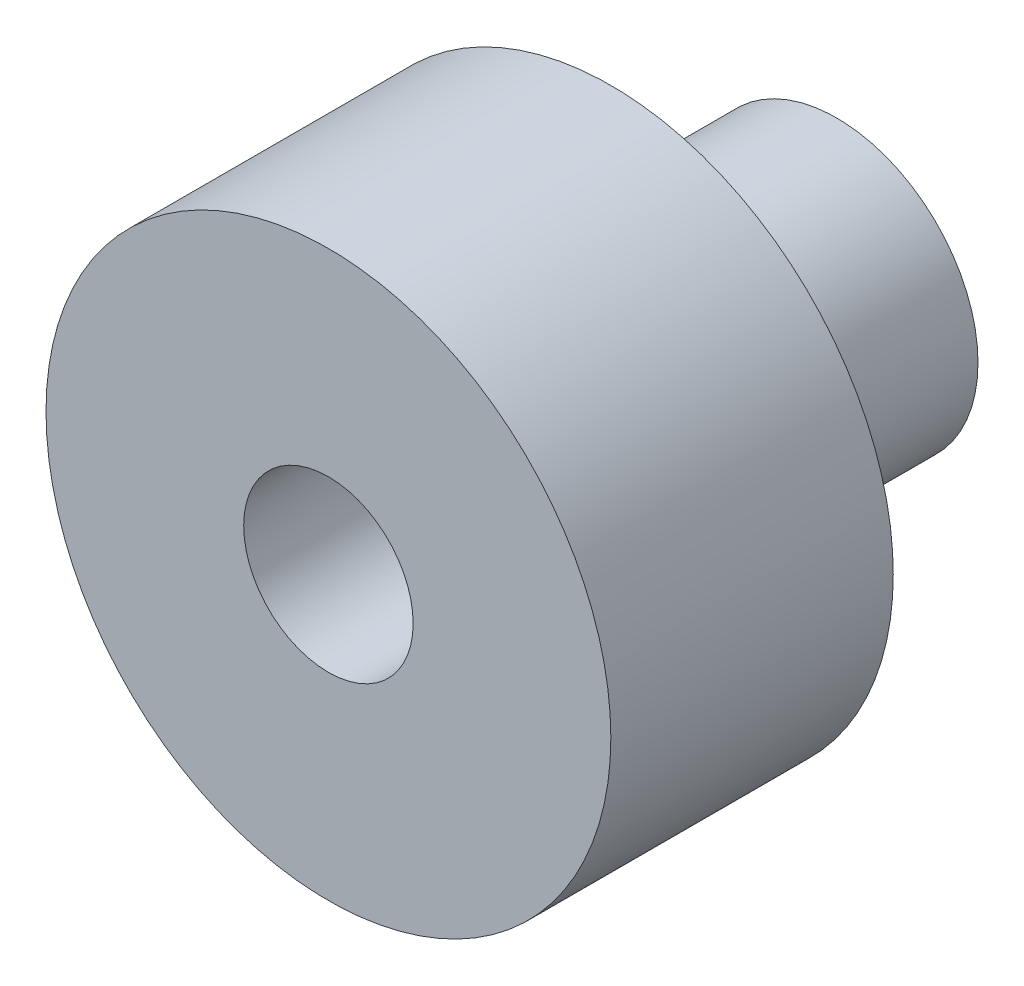
ISO-10303-21;
HEADER;
FILE_DESCRIPTION(('STEP AP214'),'2;1');
FILE_NAME('part.step','',(''),(''),'','','');
FILE_SCHEMA(('AUTOMOTIVE_DESIGN { 1 0 10303 214 1 1 1 1 }'));
ENDSEC;
DATA;
#1=APPLICATION_CONTEXT('core data for automotive mechanical design processes');
#2=APPLICATION_PROTOCOL_DEFINITION('international standard','automotive_design',2000,#1);
#3=PRODUCT_CONTEXT('',#1,'mechanical');
#4=PRODUCT('Part','Part','',(#3));
#5=PRODUCT_RELATED_PRODUCT_CATEGORY('part','',(#4));
#6=PRODUCT_DEFINITION_FORMATION('','',#4);
#7=PRODUCT_DEFINITION_CONTEXT('part definition',#1,'design');
#8=PRODUCT_DEFINITION('design','',#6,#7);
#9=PRODUCT_DEFINITION_SHAPE('','',#8);
#10=(LENGTH_UNIT() NAMED_UNIT(*) SI_UNIT(.MILLI.,.METRE.));
#11=(NAMED_UNIT(*) PLANE_ANGLE_UNIT() SI_UNIT($,.RADIAN.));
#12=(NAMED_UNIT(*) SI_UNIT($,.STERADIAN.) SOLID_ANGLE_UNIT());
#13=UNCERTAINTY_MEASURE_WITH_UNIT(LENGTH_MEASURE(1.E-05),#10,'distance_accuracy_value','');
#14=(GEOMETRIC_REPRESENTATION_CONTEXT(3) GLOBAL_UNCERTAINTY_ASSIGNED_CONTEXT((#13)) GLOBAL_UNIT_ASSIGNED_CONTEXT((#10,
#11,#12)) REPRESENTATION_CONTEXT('',''));
#15=CARTESIAN_POINT('',(0.,0.,0.));
#16=DIRECTION('',(0.,0.,1.));
#17=DIRECTION('',(1.,0.,0.));
#18=AXIS2_PLACEMENT_3D('',#15,#16,#17);
#19=CARTESIAN_POINT('',(-3.71490977829603E-05,-0.382440975897226,143.243903184503));
#20=DIRECTION('',(0.,0.,-1.));
#21=DIRECTION('',(-1.,0.,0.));
#22=AXIS2_PLACEMENT_3D('',#19,#20,#21);
#23=CYLINDRICAL_SURFACE('',#22,229.5);
#24=CARTESIAN_POINT('',(-3.71490977829603E-05,-0.382440975897226,143.243903184503));
#25=DIRECTION('',(0.,0.,1.));
#26=DIRECTION('',(1.,0.,0.));
#27=AXIS2_PLACEMENT_3D('',#24,#25,#26);
#28=CIRCLE('',#27,229.5);
#29=CARTESIAN_POINT('',(229.499962850902,-0.382440975897226,143.243903184503));
#30=VERTEX_POINT('',#29);
#31=EDGE_CURVE('E49',#30,#30,#28,.T.);
#32=ORIENTED_EDGE('',*,*,#31,.F.);
#33=EDGE_LOOP('',(#32));
#34=FACE_BOUND('',#33,.T.);
#35=CARTESIAN_POINT('',(-3.71490977829603E-05,-0.382440975897226,-86.2560968154965));
#36=DIRECTION('',(0.,0.,1.));
#37=DIRECTION('',(1.,0.,0.));
#38=AXIS2_PLACEMENT_3D('',#35,#36,#37);
#39=CIRCLE('',#38,229.5);
#40=CARTESIAN_POINT('',(229.499962850902,-0.382440975897226,-86.2560968154965));
#41=VERTEX_POINT('',#40);
#42=EDGE_CURVE('E54',#41,#41,#39,.T.);
#43=ORIENTED_EDGE('',*,*,#42,.T.);
#44=EDGE_LOOP('',(#43));
#45=FACE_BOUND('',#44,.T.);
#46=ADVANCED_FACE('F36',(#34,#45),#23,.T.);
#47=CARTESIAN_POINT('',(-3.71490977829603E-05,-0.382440975897226,143.243903184503));
#48=DIRECTION('',(0.,0.,1.));
#49=DIRECTION('',(1.,0.,0.));
#50=AXIS2_PLACEMENT_3D('',#47,#48,#49);
#51=PLANE('',#50);
#52=CARTESIAN_POINT('',(-3.71490977829603E-05,-0.382440975897226,143.243903184503));
#53=DIRECTION('',(0.,0.,1.));
#54=DIRECTION('',(1.,0.,0.));
#55=AXIS2_PLACEMENT_3D('',#52,#53,#54);
#56=CIRCLE('',#55,68.85);
#57=CARTESIAN_POINT('',(68.8499628509022,-0.382440975897226,143.243903184503));
#58=VERTEX_POINT('',#57);
#59=EDGE_CURVE('E64',#58,#58,#56,.T.);
#60=ORIENTED_EDGE('',*,*,#59,.F.);
#61=EDGE_LOOP('',(#60));
#62=FACE_BOUND('',#61,.T.);
#63=ORIENTED_EDGE('',*,*,#31,.T.);
#64=EDGE_LOOP('',(#63));
#65=FACE_BOUND('',#64,.T.);
#66=ADVANCED_FACE('F103',(#62,#65),#51,.T.);
#67=CARTESIAN_POINT('',(-3.71490977829603E-05,-0.382440975897226,-86.2560968154965));
#68=DIRECTION('',(0.,0.,1.));
#69=DIRECTION('',(1.,0.,0.));
#70=AXIS2_PLACEMENT_3D('',#67,#68,#69);
#71=PLANE('',#70);
#72=CARTESIAN_POINT('',(-3.71490977829603E-05,-0.382440975897226,-86.2560968154965));
#73=DIRECTION('',(0.,0.,1.));
#74=DIRECTION('',(1.,0.,0.));
#75=AXIS2_PLACEMENT_3D('',#72,#73,#74);
#76=CIRCLE('',#75,114.75);
#77=CARTESIAN_POINT('',(114.749962850902,-0.382440975897226,-86.2560968154965));
#78=VERTEX_POINT('',#77);
#79=EDGE_CURVE('E10',#78,#78,#76,.F.);
#80=ORIENTED_EDGE('',*,*,#79,.F.);
#81=EDGE_LOOP('',(#80));
#82=FACE_BOUND('',#81,.T.);
#83=ORIENTED_EDGE('',*,*,#42,.F.);
#84=EDGE_LOOP('',(#83));
#85=FACE_BOUND('',#84,.T.);
#86=ADVANCED_FACE('F98',(#82,#85),#71,.F.);
#87=CARTESIAN_POINT('',(-3.71490977829603E-05,-0.382440975897226,-269.856096815497));
#88=DIRECTION('',(0.,0.,1.));
#89=DIRECTION('',(1.,0.,0.));
#90=AXIS2_PLACEMENT_3D('',#87,#88,#89);
#91=CYLINDRICAL_SURFACE('',#90,114.75);
#92=CARTESIAN_POINT('',(-3.71490977829603E-05,-115.132440975897,-166.581096815496));
#93=CARTESIAN_POINT('',(0.94426068329865,-115.132439798018,-166.581098646562));
#94=CARTESIAN_POINT('',(1.88859081741395,-115.120757038656,-166.619982774461));
#95=CARTESIAN_POINT('',(3.770316240759,-115.07434508917,-166.775169022765));
#96=CARTESIAN_POINT('',(4.70771121160628,-115.039614847529,-166.891474675443));
#97=CARTESIAN_POINT('',(6.56896522362356,-114.948051516022,-167.200490797956));
#98=CARTESIAN_POINT('',(7.492820719559,-114.891212740791,-167.393220921127));
#99=CARTESIAN_POINT('',(9.32018000327388,-114.756981202807,-167.853390196591));
#100=CARTESIAN_POINT('',(10.2236839396501,-114.679588590179,-168.12082880321));
#101=CARTESIAN_POINT('',(12.0028113706781,-114.506460517735,-168.727708505027));
#102=CARTESIAN_POINT('',(12.8784748056081,-114.410752858891,-169.06704055354));
#103=CARTESIAN_POINT('',(14.597590743527,-114.203447150019,-169.815253354025));
#104=CARTESIAN_POINT('',(15.4410432247888,-114.091849089274,-170.224134152907));
#105=CARTESIAN_POINT('',(17.0904890544393,-113.855656700152,-171.108432967046));
#106=CARTESIAN_POINT('',(17.8964790437854,-113.731061209609,-171.583856933566));
#107=CARTESIAN_POINT('',(19.4660182926464,-113.47208659152,-172.597888481547));
#108=CARTESIAN_POINT('',(20.2295666844997,-113.337707264086,-173.136497354038));
#109=CARTESIAN_POINT('',(21.7288255342502,-113.059037396516,-174.288058766307));
#110=CARTESIAN_POINT('',(22.4633052916551,-112.914580408558,-174.902573779885));
#111=CARTESIAN_POINT('',(23.8782549068279,-112.622859726357,-176.190316908339));
#112=CARTESIAN_POINT('',(24.5587239057665,-112.475595987531,-176.863545956475));
#113=CARTESIAN_POINT('',(25.8614857610329,-112.182217887311,-178.264562262617));
#114=CARTESIAN_POINT('',(26.4837693237262,-112.036103712933,-178.992358202951));
#115=CARTESIAN_POINT('',(27.6660138815944,-111.749052950274,-180.497894828522));
#116=CARTESIAN_POINT('',(28.2259742736437,-111.608116412108,-181.275635996982));
#117=CARTESIAN_POINT('',(29.2916509472361,-111.332291640476,-182.894290186019));
#118=CARTESIAN_POINT('',(29.7958602642175,-111.197611309738,-183.736231901548));
#119=CARTESIAN_POINT('',(30.7313210858486,-110.941843083676,-185.461729699889));
#120=CARTESIAN_POINT('',(31.1625712101458,-110.820755445532,-186.345286569635));
#121=CARTESIAN_POINT('',(31.9485247444545,-110.595956748566,-188.147773910558));
#122=CARTESIAN_POINT('',(32.3032424859932,-110.492242437213,-189.066697720844));
#123=CARTESIAN_POINT('',(32.933121434911,-110.305494171609,-190.933462190101));
#124=CARTESIAN_POINT('',(33.2082854762316,-110.222459480704,-191.881301817673));
#125=CARTESIAN_POINT('',(33.669945317301,-110.081809262991,-193.771931889222));
#126=CARTESIAN_POINT('',(33.8587075543956,-110.023547253242,-194.714120961195));
#127=CARTESIAN_POINT('',(34.156903001813,-109.931016512797,-196.612142022969));
#128=CARTESIAN_POINT('',(34.2663375688975,-109.896747371746,-197.567973779151));
#129=CARTESIAN_POINT('',(34.4048098386813,-109.85332428343,-199.485811894442));
#130=CARTESIAN_POINT('',(34.4338644450535,-109.844165055627,-200.447816912674));
#131=CARTESIAN_POINT('',(34.4113386419536,-109.851248759234,-202.370777212264));
#132=CARTESIAN_POINT('',(34.3597599715969,-109.867491142777,-203.331732515815));
#133=CARTESIAN_POINT('',(34.1797979207596,-109.923802097654,-205.21058511903));
#134=CARTESIAN_POINT('',(34.0542587371787,-109.962988032493,-206.128783068287));
#135=CARTESIAN_POINT('',(33.7298722191254,-110.063271088308,-207.95088826176));
#136=CARTESIAN_POINT('',(33.5310269131535,-110.124367602982,-208.854795900692));
#137=CARTESIAN_POINT('',(33.0617108133234,-110.266668043299,-210.642245074675));
#138=CARTESIAN_POINT('',(32.7912351702995,-110.347873330225,-211.525785226503));
#139=CARTESIAN_POINT('',(32.1808526541593,-110.528044576437,-213.266677259572));
#140=CARTESIAN_POINT('',(31.8409442541133,-110.62701092631,-214.124028564404));
#141=CARTESIAN_POINT('',(31.0891759494644,-110.841384014473,-215.818673094525));
#142=CARTESIAN_POINT('',(30.6763959291219,-110.95699701163,-216.655531874013));
#143=CARTESIAN_POINT('',(29.7851663574879,-111.200388204158,-218.291643182319));
#144=CARTESIAN_POINT('',(29.306716508575,-111.328166454662,-219.090895540679));
#145=CARTESIAN_POINT('',(28.2873059487843,-111.592449205551,-220.647184679678));
#146=CARTESIAN_POINT('',(27.7463326794993,-111.728955456567,-221.404212933785));
#147=CARTESIAN_POINT('',(26.6054189263246,-112.007065930126,-222.871458084928));
#148=CARTESIAN_POINT('',(26.005476834025,-112.148670291655,-223.581673704238));
#149=CARTESIAN_POINT('',(24.7240395205851,-112.439265308926,-224.979769490679));
#150=CARTESIAN_POINT('',(24.0401836541958,-112.588317299601,-225.665475203903));
#151=CARTESIAN_POINT('',(22.6168361890412,-112.883853288493,-226.977124965846));
#152=CARTESIAN_POINT('',(21.8773430307133,-113.030337214583,-227.603067338228));
#153=CARTESIAN_POINT('',(20.3473680735811,-113.316719338763,-228.791016639847));
#154=CARTESIAN_POINT('',(19.5568825598722,-113.456617055746,-229.353018902645));
#155=CARTESIAN_POINT('',(17.9300416697401,-113.725965046413,-230.409044350509));
#156=CARTESIAN_POINT('',(17.0936866200476,-113.855415394498,-230.903068019701));
#157=CARTESIAN_POINT('',(15.3748032492338,-114.101108949877,-231.822508676288));
#158=CARTESIAN_POINT('',(14.4920014759049,-114.217257158449,-232.247440299029));
#159=CARTESIAN_POINT('',(12.6915467508762,-114.432026774746,-233.02116143754));
#160=CARTESIAN_POINT('',(11.7738934723289,-114.530648018049,-233.369950239014));
#161=CARTESIAN_POINT('',(9.91056248178222,-114.707495274815,-233.98827347643));
#162=CARTESIAN_POINT('',(8.96489117100114,-114.785725907466,-234.257825863965));
#163=CARTESIAN_POINT('',(7.05243729658008,-114.919525592067,-234.715291510999));
#164=CARTESIAN_POINT('',(6.0856555052404,-114.975095471574,-234.903207751817));
#165=CARTESIAN_POINT('',(4.17344663914045,-115.060370101105,-235.190356625283));
#166=CARTESIAN_POINT('',(3.22849848506302,-115.090931588566,-235.292530117856));
#167=CARTESIAN_POINT('',(1.33293101962508,-115.128614040089,-235.418391180098));
#168=CARTESIAN_POINT('',(0.38231184460084,-115.13573556541,-235.442080629034));
#169=CARTESIAN_POINT('',(-1.51739132514032,-115.126339753196,-235.410756979506));
#170=CARTESIAN_POINT('',(-2.46647549130875,-115.109825268847,-235.355753380355));
#171=CARTESIAN_POINT('',(-4.35616015435032,-115.053623933618,-235.167571876531));
#172=CARTESIAN_POINT('',(-5.29676071118068,-115.013937246636,-235.034394524785));
#173=CARTESIAN_POINT('',(-7.14144894189071,-114.91364504883,-234.694973786474));
#174=CARTESIAN_POINT('',(-8.045881183775,-114.853533334261,-234.490452361891));
#175=CARTESIAN_POINT('',(-9.83388580102112,-114.713810556719,-234.009628056342));
#176=CARTESIAN_POINT('',(-10.7174585803943,-114.634199871749,-233.733326566877));
#177=CARTESIAN_POINT('',(-12.458018839059,-114.457532648787,-233.111136731353));
#178=CARTESIAN_POINT('',(-13.3150040735934,-114.360474642412,-232.765242528012));
#179=CARTESIAN_POINT('',(-14.996910288918,-114.151393485227,-232.006509834504));
#180=CARTESIAN_POINT('',(-15.8218304865135,-114.039369969176,-231.593669710442));
#181=CARTESIAN_POINT('',(-17.4532346801862,-113.800445297048,-230.693708995585));
#182=CARTESIAN_POINT('',(-18.258851351423,-113.673260027795,-230.205091589248));
#183=CARTESIAN_POINT('',(-19.8262955648151,-113.409489631534,-229.164313826139));
#184=CARTESIAN_POINT('',(-20.5881225785248,-113.272904391133,-228.612152702773));
#185=CARTESIAN_POINT('',(-22.0635621077711,-112.99384037247,-227.447821931264));
#186=CARTESIAN_POINT('',(-22.7771641387352,-112.851360323406,-226.835639304322));
#187=CARTESIAN_POINT('',(-24.1517103281362,-112.56422319581,-225.555222577535));
#188=CARTESIAN_POINT('',(-24.8126533340442,-112.419566069713,-224.886987251543));
#189=CARTESIAN_POINT('',(-26.1008855548203,-112.126614665931,-223.473267672056));
#190=CARTESIAN_POINT('',(-26.7260773281543,-111.97837938449,-222.725858091221));
#191=CARTESIAN_POINT('',(-27.9113857513364,-111.687838918562,-221.179989559957));
#192=CARTESIAN_POINT('',(-28.4715006759708,-111.545533891352,-220.381529257021));
#193=CARTESIAN_POINT('',(-29.5226719805806,-111.270996458868,-218.738710073049));
#194=CARTESIAN_POINT('',(-30.0137283633368,-111.138764053187,-217.89435119386));
#195=CARTESIAN_POINT('',(-30.9230542658824,-110.888332426505,-216.165308448995));
#196=CARTESIAN_POINT('',(-31.3413250125348,-110.770132968977,-215.280625263336));
#197=CARTESIAN_POINT('',(-32.0999043706479,-110.551929422998,-213.48119196841));
#198=CARTESIAN_POINT('',(-32.4405687202709,-110.451842760647,-212.566601967934));
#199=CARTESIAN_POINT('',(-33.0434783156257,-110.272352052686,-210.709923641472));
#200=CARTESIAN_POINT('',(-33.3057235106571,-110.192948020447,-209.767835297708));
#201=CARTESIAN_POINT('',(-33.749308008716,-110.057429379257,-207.863423995334));
#202=CARTESIAN_POINT('',(-33.9306705414405,-110.001308083771,-206.901106929712));
#203=CARTESIAN_POINT('',(-34.210831544661,-109.914197456251,-204.96341226599));
#204=CARTESIAN_POINT('',(-34.3096331611079,-109.883207166612,-203.988035166975));
#205=CARTESIAN_POINT('',(-34.4213148954609,-109.848149404307,-202.072757499967));
#206=CARTESIAN_POINT('',(-34.4376064050432,-109.84301305418,-201.133073793752));
#207=CARTESIAN_POINT('',(-34.3933262644421,-109.856934467098,-199.255717276372));
#208=CARTESIAN_POINT('',(-34.3327568602962,-109.87599152316,-198.318044407247));
#209=CARTESIAN_POINT('',(-34.1353252069793,-109.937702139948,-196.45160739566));
#210=CARTESIAN_POINT('',(-33.998466422299,-109.980354629145,-195.522842850597));
#211=CARTESIAN_POINT('',(-33.6497004615321,-110.087937167495,-193.68083527213));
#212=CARTESIAN_POINT('',(-33.4377929370001,-110.152867320082,-192.767592310812));
#213=CARTESIAN_POINT('',(-32.9438802971712,-110.302099378738,-190.974243975845));
#214=CARTESIAN_POINT('',(-32.6627822540336,-110.3861496214,-190.093867386113));
#215=CARTESIAN_POINT('',(-32.0314666203867,-110.571633614522,-188.36017954569));
#216=CARTESIAN_POINT('',(-31.681249927128,-110.673067139323,-187.506867943827));
#217=CARTESIAN_POINT('',(-30.9142786085392,-110.890499384588,-185.832488212819));
#218=CARTESIAN_POINT('',(-30.4975142263778,-111.006500240297,-185.011424833748));
#219=CARTESIAN_POINT('',(-29.6004133615675,-111.249912091248,-183.406564982188));
#220=CARTESIAN_POINT('',(-29.1200749672269,-111.37732342957,-182.622769631324));
#221=CARTESIAN_POINT('',(-28.0803756114625,-111.644993302881,-181.069186919763));
#222=CARTESIAN_POINT('',(-27.5187730899303,-111.7855507879,-180.300950478604));
#223=CARTESIAN_POINT('',(-26.3344165349222,-112.071446599683,-178.814104907323));
#224=CARTESIAN_POINT('',(-25.7116611336042,-112.216785033337,-178.095496887881));
#225=CARTESIAN_POINT('',(-24.4088032429892,-112.508353433688,-176.712152486944));
#226=CARTESIAN_POINT('',(-23.7286869248527,-112.654583607443,-176.047429172413));
#227=CARTESIAN_POINT('',(-22.3154417955076,-112.944003674245,-174.776215422989));
#228=CARTESIAN_POINT('',(-21.5823125106244,-113.087193540112,-174.169725508529));
#229=CARTESIAN_POINT('',(-20.0453260575926,-113.370834944874,-173.002070921371));
#230=CARTESIAN_POINT('',(-19.2400263875684,-113.511083500348,-172.442753660293));
#231=CARTESIAN_POINT('',(-17.5832634110734,-113.780399097378,-171.394073188809));
#232=CARTESIAN_POINT('',(-16.7317982635511,-113.90946569247,-170.904712771074));
#233=CARTESIAN_POINT('',(-14.9888236838725,-114.152703654096,-169.999957943411));
#234=CARTESIAN_POINT('',(-14.0973304874519,-114.266880987775,-169.584533877629));
#235=CARTESIAN_POINT('',(-12.2802645573057,-114.477114918205,-168.830891759201));
#236=CARTESIAN_POINT('',(-11.3546951222618,-114.573173263446,-168.492666256204));
#237=CARTESIAN_POINT('',(-9.5769815590781,-114.735201646837,-167.92835691748));
#238=CARTESIAN_POINT('',(-8.72760302053467,-114.803293286139,-167.694138237535));
#239=CARTESIAN_POINT('',(-7.0122189167235,-114.921214679269,-167.291323082529));
#240=CARTESIAN_POINT('',(-6.14621476694592,-114.971045980574,-167.122721046696));
#241=CARTESIAN_POINT('',(-4.40305041229673,-115.051255855086,-166.852445372822));
#242=CARTESIAN_POINT('',(-3.52589177363745,-115.081637129193,-166.750762442101));
#243=CARTESIAN_POINT('',(-1.7658441215184,-115.122230868028,-166.615085200553));
#244=CARTESIAN_POINT('',(-0.88295475476543,-115.132442077213,-166.581095103452));
#245=CARTESIAN_POINT('',(-3.71490977829603E-05,-115.132440975897,-166.581096815496));
#246=B_SPLINE_CURVE_WITH_KNOTS('',3,(#92,#93,#94,#95,#96,#97,#98,#99,#100,#101,#102,#103,#104,
#105,#106,#107,#108,#109,#110,#111,#112,#113,#114,#115,#116,#117,#118,#119,#120,#121,#122,#123,
#124,#125,#126,#127,#128,#129,#130,#131,#132,#133,#134,#135,#136,#137,#138,#139,#140,#141,#142,
#143,#144,#145,#146,#147,#148,#149,#150,#151,#152,#153,#154,#155,#156,#157,#158,#159,#160,#161,
#162,#163,#164,#165,#166,#167,#168,#169,#170,#171,#172,#173,#174,#175,#176,#177,#178,#179,#180,
#181,#182,#183,#184,#185,#186,#187,#188,#189,#190,#191,#192,#193,#194,#195,#196,#197,#198,#199,
#200,#201,#202,#203,#204,#205,#206,#207,#208,#209,#210,#211,#212,#213,#214,#215,#216,#217,#218,
#219,#220,#221,#222,#223,#224,#225,#226,#227,#228,#229,#230,#231,#232,#233,#234,#235,#236,#237,
#238,#239,#240,#241,#242,#243,#244,#245),.UNSPECIFIED.,.T.,.F.,(4,2,2,2,2,2,2,2,2,2,2,2,2,2,2,2,
2,2,2,2,2,2,2,2,2,2,2,2,2,2,2,2,2,2,2,2,2,2,2,2,2,2,2,2,2,2,2,2,2,2,2,2,2,2,2,2,2,2,2,2,2,2,2,2,
2,2,2,2,2,2,2,2,2,2,2,2,4),(0.,2.83208055464589,5.66429032877942,8.49722890750467,
11.3301467948422,14.1587981375523,16.9874513882286,19.8163577803508,22.6453219844145,
25.5474514578185,28.4496270689691,31.3522654393802,34.2549318973146,37.2230176479776,
40.191159547107,43.1587451458038,46.1262250171661,49.0106375199424,51.8950006887004,
54.7787572381117,57.6624515909136,60.4418895625689,63.2212506283937,66.0007998970027,
68.7804102986266,71.5980205022171,74.4156434758901,77.2338333819883,80.0521001772347,
82.9881675880798,85.924317330185,88.8606812193257,91.797024195334,94.7531781477845,
97.7093598307403,100.664871251836,103.620274729827,106.469606471744,109.318869987104,
112.167789586878,115.016689036336,117.80110797728,120.585472944577,123.370072356513,
126.154739740141,129.00379511218,131.852884858883,134.702592045366,137.552361585233,
140.505748405745,143.459213503887,146.412678483097,149.366093674352,152.305685426566,
155.245279079309,158.18402792906,161.12266479385,163.938750274929,166.754753465961,
169.570628785692,172.386517179481,175.16729131831,177.94802936143,180.729175475011,
183.510405237585,186.392970782514,189.275600818159,192.158927809289,195.042280566328,
198.010069789415,200.977977453327,203.944691994084,206.91112009924,209.559540310174,
212.207736028184,214.855563928477,217.503556644948),.UNSPECIFIED.);
#247=CARTESIAN_POINT('',(-3.71490977829603E-05,-115.132440975897,-166.581096815496));
#248=VERTEX_POINT('',#247);
#249=EDGE_CURVE('E72',#248,#248,#246,.T.);
#250=ORIENTED_EDGE('',*,*,#249,.T.);
#251=EDGE_LOOP('',(#250));
#252=FACE_BOUND('',#251,.T.);
#253=CARTESIAN_POINT('',(-3.71490977829603E-05,-0.382440975897226,-269.856096815497));
#254=DIRECTION('',(0.,0.,-1.));
#255=DIRECTION('',(-1.,0.,0.));
#256=AXIS2_PLACEMENT_3D('',#253,#254,#255);
#257=CIRCLE('',#256,114.75);
#258=CARTESIAN_POINT('',(-114.750037149098,-0.382440975897226,-269.856096815497));
#259=VERTEX_POINT('',#258);
#260=EDGE_CURVE('E59',#259,#259,#257,.T.);
#261=ORIENTED_EDGE('',*,*,#260,.F.);
#262=EDGE_LOOP('',(#261));
#263=FACE_BOUND('',#262,.T.);
#264=ORIENTED_EDGE('',*,*,#79,.T.);
#265=EDGE_LOOP('',(#264));
#266=FACE_BOUND('',#265,.T.);
#267=ADVANCED_FACE('F79',(#252,#263,#266),#91,.T.);
#268=CARTESIAN_POINT('',(-3.71490977829603E-05,-0.382440975897226,-269.856096815497));
#269=DIRECTION('',(0.,0.,-1.));
#270=DIRECTION('',(-1.,0.,0.));
#271=AXIS2_PLACEMENT_3D('',#268,#269,#270);
#272=PLANE('',#271);
#273=CARTESIAN_POINT('',(-3.71490977829603E-05,-0.382440975897226,-269.856096815497));
#274=DIRECTION('',(0.,0.,-1.));
#275=DIRECTION('',(-1.,0.,0.));
#276=AXIS2_PLACEMENT_3D('',#273,#274,#275);
#277=CIRCLE('',#276,68.85);
#278=CARTESIAN_POINT('',(-68.8500371490978,-0.382440975897226,-269.856096815497));
#279=VERTEX_POINT('',#278);
#280=EDGE_CURVE('E68',#279,#279,#277,.T.);
#281=ORIENTED_EDGE('',*,*,#280,.F.);
#282=EDGE_LOOP('',(#281));
#283=FACE_BOUND('',#282,.T.);
#284=ORIENTED_EDGE('',*,*,#260,.T.);
#285=EDGE_LOOP('',(#284));
#286=FACE_BOUND('',#285,.T.);
#287=ADVANCED_FACE('F91',(#283,#286),#272,.T.);
#288=CARTESIAN_POINT('',(-3.71490977829603E-05,-0.382440975897226,349.793903184504));
#289=DIRECTION('',(0.,0.,-1.));
#290=DIRECTION('',(-1.,0.,0.));
#291=AXIS2_PLACEMENT_3D('',#288,#289,#290);
#292=CYLINDRICAL_SURFACE('',#291,68.85);
#293=CARTESIAN_POINT('',(-3.71490977829603E-05,-69.2324409758972,-166.581096815496));
#294=CARTESIAN_POINT('',(-0.905362283229152,-69.2324397210335,-166.581097494216));
#295=CARTESIAN_POINT('',(-1.81070873399686,-69.2145441073232,-166.616848327694));
#296=CARTESIAN_POINT('',(-3.61475627814511,-69.1434159256271,-166.759438987402));
#297=CARTESIAN_POINT('',(-4.5134543085345,-69.0901679849548,-166.866309739627));
#298=CARTESIAN_POINT('',(-6.29854795206765,-68.949592280983,-167.150114051225));
#299=CARTESIAN_POINT('',(-7.18492029639018,-68.8622072716924,-167.327165306809));
#300=CARTESIAN_POINT('',(-8.93739262178502,-68.6556030650851,-167.749268659594));
#301=CARTESIAN_POINT('',(-9.8034946209179,-68.5363870515664,-167.994313955995));
#302=CARTESIAN_POINT('',(-11.5064846412521,-68.2695841379195,-168.548723103464));
#303=CARTESIAN_POINT('',(-12.3434736776599,-68.1221100292064,-168.857831635316));
#304=CARTESIAN_POINT('',(-13.9868606031625,-67.801964762937,-169.538012609286));
#305=CARTESIAN_POINT('',(-14.7932578331552,-67.6292930628854,-169.90908638552));
#306=CARTESIAN_POINT('',(-16.3710360961998,-67.2626980616219,-170.709997576792));
#307=CARTESIAN_POINT('',(-17.142423703482,-67.0687787739035,-171.139823897744));
#308=CARTESIAN_POINT('',(-18.6467079960477,-66.6638939030619,-172.055145467462));
#309=CARTESIAN_POINT('',(-19.3796033095289,-66.4529277130944,-172.540642698286));
#310=CARTESIAN_POINT('',(-20.8468339258869,-66.0052788499173,-173.595213953268));
#311=CARTESIAN_POINT('',(-21.578574490268,-65.7678125200524,-174.167567126569));
#312=CARTESIAN_POINT('',(-22.9918421995116,-65.2843465508407,-175.367897575207));
#313=CARTESIAN_POINT('',(-23.6733676135188,-65.0383466177803,-175.995876766266));
#314=CARTESIAN_POINT('',(-24.9836645874056,-64.5434226110973,-177.304686345922));
#315=CARTESIAN_POINT('',(-25.612398515832,-64.2944965933665,-177.985553780443));
#316=CARTESIAN_POINT('',(-26.5130686847174,-63.9236653553561,-179.043529243122));
#317=CARTESIAN_POINT('',(-26.8062323403591,-63.8004758373903,-179.402316831148));
#318=CARTESIAN_POINT('',(-27.3781766129613,-63.5556691541023,-180.131878047573));
#319=CARTESIAN_POINT('',(-27.6569529713687,-63.4340524622194,-180.502655172577));
#320=CARTESIAN_POINT('',(-28.5130826077377,-63.0541084454477,-181.69063397416));
#321=CARTESIAN_POINT('',(-29.0634688972978,-62.80009027455,-182.528914703809));
#322=CARTESIAN_POINT('',(-30.0911105491697,-62.3112211423689,-184.25449778598));
#323=CARTESIAN_POINT('',(-30.5683705498699,-62.0763689658316,-185.141797024405));
#324=CARTESIAN_POINT('',(-31.2260509430671,-61.7446345271816,-186.505357538765));
#325=CARTESIAN_POINT('',(-31.435567653315,-61.6374849088557,-186.965290585943));
#326=CARTESIAN_POINT('',(-31.8346818499819,-61.431014853366,-187.895339009781));
#327=CARTESIAN_POINT('',(-32.024284380428,-61.3316924352637,-188.365451771475));
#328=CARTESIAN_POINT('',(-32.383064300927,-61.1418293355686,-189.31516758793));
#329=CARTESIAN_POINT('',(-32.5522414287664,-61.0512887667167,-189.794770764433));
#330=CARTESIAN_POINT('',(-32.8696296669928,-60.8799189681677,-190.762563188842));
#331=CARTESIAN_POINT('',(-33.0178397308689,-60.7990902232386,-191.250752863951));
#332=CARTESIAN_POINT('',(-33.4137645976001,-60.5815511412937,-192.667911147747));
#333=CARTESIAN_POINT('',(-33.6342910332123,-60.4582473610271,-193.606766464717));
#334=CARTESIAN_POINT('',(-33.9962269935708,-60.2541776301926,-195.504048129151));
#335=CARTESIAN_POINT('',(-34.1376399026726,-60.1734098600081,-196.462473637614));
#336=CARTESIAN_POINT('',(-34.3391352395796,-60.0579169260141,-198.389835741873));
#337=CARTESIAN_POINT('',(-34.3992864595963,-60.0231528182423,-199.358762746184));
#338=CARTESIAN_POINT('',(-34.4374587417638,-60.0011217990603,-201.298720952138));
#339=CARTESIAN_POINT('',(-34.4154876398454,-60.0138503560047,-202.269751944187));
#340=CARTESIAN_POINT('',(-34.2973646114996,-60.0818504653854,-204.088708115782));
#341=CARTESIAN_POINT('',(-34.2104121661298,-60.1318442425084,-204.937448834522));
#342=CARTESIAN_POINT('',(-33.9743102390923,-60.2664099870507,-206.623371008742));
#343=CARTESIAN_POINT('',(-33.825166594096,-60.3509787095818,-207.460553541349));
#344=CARTESIAN_POINT('',(-33.4663648093762,-60.5519480098335,-209.118118756511));
#345=CARTESIAN_POINT('',(-33.2566915090956,-60.6683565619312,-209.938497175027));
#346=CARTESIAN_POINT('',(-32.77901574173,-60.9294065959805,-211.55747639097));
#347=CARTESIAN_POINT('',(-32.5110101676358,-61.0740495817683,-212.356076025822));
#348=CARTESIAN_POINT('',(-31.9122304187125,-61.3910612196412,-213.945591198447));
#349=CARTESIAN_POINT('',(-31.5801443202331,-61.5639952309271,-214.735898677178));
#350=CARTESIAN_POINT('',(-30.8601286608951,-61.9303110185412,-216.285674272167));
#351=CARTESIAN_POINT('',(-30.4721990728208,-62.1236928048348,-217.045142373394));
#352=CARTESIAN_POINT('',(-29.6429975804339,-62.5260633827202,-218.530343175856));
#353=CARTESIAN_POINT('',(-29.2017077865662,-62.7350573994464,-219.256064449589));
#354=CARTESIAN_POINT('',(-28.2683102773641,-63.1637350784777,-220.670876491043));
#355=CARTESIAN_POINT('',(-27.7761984865977,-63.3834195973094,-221.359964314392));
#356=CARTESIAN_POINT('',(-26.9690410981875,-63.7314405776766,-222.406574949741));
#357=CARTESIAN_POINT('',(-26.6704423441074,-63.8578041901332,-222.777561225742));
#358=CARTESIAN_POINT('',(-26.0583680679227,-64.1115210324557,-223.506552262453));
#359=CARTESIAN_POINT('',(-25.7448956242631,-64.2388740530177,-223.864559682604));
#360=CARTESIAN_POINT('',(-24.7825817275488,-64.6212474408497,-224.918674499712));
#361=CARTESIAN_POINT('',(-24.111829428105,-64.8765883563244,-225.594892962758));
#362=CARTESIAN_POINT('',(-22.7151923900942,-65.3816408615002,-226.890654889266));
#363=CARTESIAN_POINT('',(-21.9892821060055,-65.6313497725446,-227.510171795897));
#364=CARTESIAN_POINT('',(-20.4859724252124,-66.1188331262324,-228.688565959729));
#365=CARTESIAN_POINT('',(-19.7085726567931,-66.3566074826957,-229.247442779078));
#366=CARTESIAN_POINT('',(-18.0687803521621,-66.8249226035463,-230.325168674345));
#367=CARTESIAN_POINT('',(-17.2041154343134,-67.054610201543,-230.840939638556));
#368=CARTESIAN_POINT('',(-15.4277045935824,-67.4879199977112,-231.797087352687));
#369=CARTESIAN_POINT('',(-14.5159564807844,-67.6915409819471,-232.237460591618));
#370=CARTESIAN_POINT('',(-12.6521203508281,-68.066635762164,-233.037851353885));
#371=CARTESIAN_POINT('',(-11.7000584437196,-68.2381299867583,-233.397919968895));
#372=CARTESIAN_POINT('',(-9.76235664016373,-68.5438756227134,-234.033616582028));
#373=CARTESIAN_POINT('',(-8.77672062095869,-68.678131318233,-234.309254294004));
#374=CARTESIAN_POINT('',(-6.86300796647743,-68.8957345878437,-234.75315105209));
#375=CARTESIAN_POINT('',(-5.93692646543164,-68.9823779193125,-234.928413477581));
#376=CARTESIAN_POINT('',(-4.07081386352528,-69.1183574016808,-235.20256699403));
#377=CARTESIAN_POINT('',(-3.13078352425753,-69.1676955818185,-235.301462239037));
#378=CARTESIAN_POINT('',(-1.24491900068138,-69.2276476708706,-235.421548428026));
#379=CARTESIAN_POINT('',(-0.299087288514402,-69.238277062771,-235.442770440256));
#380=CARTESIAN_POINT('',(1.59072588212022,-69.2205462147704,-235.40730504234));
#381=CARTESIAN_POINT('',(2.53470742062101,-69.1921877003917,-235.350621080149));
#382=CARTESIAN_POINT('',(4.33990804418032,-69.1009964581115,-235.167531951053));
#383=CARTESIAN_POINT('',(5.20186304088208,-69.0410109314684,-235.046880979463));
#384=CARTESIAN_POINT('',(6.91148178121952,-68.8900296645987,-234.7413229887));
#385=CARTESIAN_POINT('',(7.7591464407085,-68.7990359196473,-234.556420103908));
#386=CARTESIAN_POINT('',(9.43476851103413,-68.5881602195185,-234.124276088342));
#387=CARTESIAN_POINT('',(10.2627248230337,-68.4682766577178,-233.877031490579));
#388=CARTESIAN_POINT('',(11.8939775321449,-68.2023345638289,-233.322582309797));
#389=CARTESIAN_POINT('',(12.6972728914826,-68.0562749319717,-233.015375207448));
#390=CARTESIAN_POINT('',(14.2973523792769,-67.7366660419542,-232.334084663747));
#391=CARTESIAN_POINT('',(15.0932968804457,-67.5624513876121,-231.958343284779));
#392=CARTESIAN_POINT('',(16.6503870311828,-67.1935639078455,-231.149319202082));
#393=CARTESIAN_POINT('',(17.4115323749186,-66.9988909026723,-230.716035992777));
#394=CARTESIAN_POINT('',(18.8957669598779,-66.5931893938791,-229.79485095696));
#395=CARTESIAN_POINT('',(19.6188436566546,-66.3821555549506,-229.306931290118));
#396=CARTESIAN_POINT('',(21.0236453954109,-65.9481931589615,-228.279577850229));
#397=CARTESIAN_POINT('',(21.7053681615165,-65.7252639485172,-227.740141246195));
#398=CARTESIAN_POINT('',(23.0895835571913,-65.2498338975224,-226.55718793011));
#399=CARTESIAN_POINT('',(23.7875360404133,-64.996579603091,-225.908652563937));
#400=CARTESIAN_POINT('',(25.1269167033895,-64.4876056574161,-224.556523888403));
#401=CARTESIAN_POINT('',(25.7683413907218,-64.2318858549289,-223.852927182283));
#402=CARTESIAN_POINT('',(26.9918859856416,-63.7243502342687,-222.393563857508));
#403=CARTESIAN_POINT('',(27.5739656604999,-63.4725371614249,-221.637762421563));
#404=CARTESIAN_POINT('',(28.3995073998558,-63.1030863537847,-220.46822140968));
#405=CARTESIAN_POINT('',(28.666766532807,-62.9813102647113,-220.072387357986));
#406=CARTESIAN_POINT('',(29.1851333092868,-62.7413208988607,-219.269038626431));
#407=CARTESIAN_POINT('',(29.4362356931664,-62.6231087888861,-218.861520204642));
#408=CARTESIAN_POINT('',(30.1880300148061,-62.2639514764911,-217.582294166415));
#409=CARTESIAN_POINT('',(30.6604716204027,-62.0305671927256,-216.691598595765));
#410=CARTESIAN_POINT('',(31.527564464998,-61.5916667046412,-214.866515684389));
#411=CARTESIAN_POINT('',(31.9222242193768,-61.386147450492,-213.932133140287));
#412=CARTESIAN_POINT('',(32.4523688314043,-61.1047900796597,-212.503058435025));
#413=CARTESIAN_POINT('',(32.6187370557987,-61.0155131169414,-212.022259598059));
#414=CARTESIAN_POINT('',(32.9304078897562,-60.8468083475158,-211.052278550907));
#415=CARTESIAN_POINT('',(33.0757159387435,-60.7673779983938,-210.563098542039));
#416=CARTESIAN_POINT('',(33.344782073642,-60.6192166514955,-209.577252026187));
#417=CARTESIAN_POINT('',(33.4685406723413,-60.5504853991289,-209.080585697652));
#418=CARTESIAN_POINT('',(33.6940443801774,-60.4244925884747,-208.080855074703));
#419=CARTESIAN_POINT('',(33.795788607137,-60.3672314898349,-207.577790524749));
#420=CARTESIAN_POINT('',(34.0499491097345,-60.2235385806947,-206.157875455169));
#421=CARTESIAN_POINT('',(34.1769490963052,-60.1508838693361,-205.234887610701));
#422=CARTESIAN_POINT('',(34.3557003172892,-60.0483138413842,-203.379448143154));
#423=CARTESIAN_POINT('',(34.4074566692273,-60.0183956181684,-202.446997168031));
#424=CARTESIAN_POINT('',(34.4349763959375,-60.0025099965816,-200.580913024873));
#425=CARTESIAN_POINT('',(34.4107678784503,-60.0165263419907,-199.647280421838));
#426=CARTESIAN_POINT('',(34.2867782137883,-60.0879004099878,-197.786763725602));
#427=CARTESIAN_POINT('',(34.1870001603963,-60.1452563582718,-196.8598793577));
#428=CARTESIAN_POINT('',(33.9264537105691,-60.2935056702039,-195.108530176681));
#429=CARTESIAN_POINT('',(33.7724160201624,-60.3806752625263,-194.282734105482));
#430=CARTESIAN_POINT('',(33.4054920672162,-60.5857403010521,-192.64830629999));
#431=CARTESIAN_POINT('',(33.1926104934097,-60.7036332991443,-191.839673203662));
#432=CARTESIAN_POINT('',(32.7100720978324,-60.9666523141908,-190.243919511289));
#433=CARTESIAN_POINT('',(32.4404020356338,-61.1117846812364,-189.456803980576));
#434=CARTESIAN_POINT('',(31.8466532258053,-61.4252409364251,-187.908128687114));
#435=CARTESIAN_POINT('',(31.5225708795644,-61.593566358332,-187.146570618633));
#436=CARTESIAN_POINT('',(30.798922629952,-61.9610255687576,-185.60220280859));
#437=CARTESIAN_POINT('',(30.3957506937006,-62.1614687897004,-184.821396528208));
#438=CARTESIAN_POINT('',(29.5329972836396,-62.5785165525809,-183.295978019916));
#439=CARTESIAN_POINT('',(29.0734107617863,-62.7951225401009,-182.551369039316));
#440=CARTESIAN_POINT('',(28.3438032730569,-63.1281242471785,-181.463882933298));
#441=CARTESIAN_POINT('',(28.0938036158158,-63.2405134935594,-181.106174631299));
#442=CARTESIAN_POINT('',(27.58077776796,-63.4673028162094,-180.401016657886));
#443=CARTESIAN_POINT('',(27.3177547113221,-63.5817024044724,-180.053564550215));
#444=CARTESIAN_POINT('',(26.5094706396357,-63.927005973783,-179.026892946851));
#445=CARTESIAN_POINT('',(25.9449975429875,-64.1600134604188,-178.363362371273));
#446=CARTESIAN_POINT('',(24.6958847984893,-64.6548174533091,-177.003067885369));
#447=CARTESIAN_POINT('',(24.0049798909699,-64.9166687102998,-176.312076962121));
#448=CARTESIAN_POINT('',(22.5655603596853,-65.4339680933939,-174.990153539927));
#449=CARTESIAN_POINT('',(21.8170408235023,-65.6894156710309,-174.359226172485));
#450=CARTESIAN_POINT('',(20.2657306786641,-66.187342514201,-173.161164500673));
#451=CARTESIAN_POINT('',(19.4629082547308,-66.4298140256127,-172.594068121419));
#452=CARTESIAN_POINT('',(17.8076569003243,-66.8952030904091,-171.528386049492));
#453=CARTESIAN_POINT('',(16.9552308322149,-67.1181217702265,-171.029796409227));
#454=CARTESIAN_POINT('',(15.199361537634,-67.5398796802848,-170.102187312185));
#455=CARTESIAN_POINT('',(14.2955969476208,-67.7385352275947,-169.673691105276));
#456=CARTESIAN_POINT('',(12.4485686751267,-68.1042340007535,-168.895077877408));
#457=CARTESIAN_POINT('',(11.5052993564837,-68.2712726969154,-168.544972085985));
#458=CARTESIAN_POINT('',(9.58862312043997,-68.5683435391269,-167.928181195417));
#459=CARTESIAN_POINT('',(8.61529809163352,-68.6984678308641,-167.661288212461));
#460=CARTESIAN_POINT('',(7.13787212590224,-68.8632330476916,-167.325445840719));
#461=CARTESIAN_POINT('',(6.64255109371056,-68.9130804115066,-167.224256203994));
#462=CARTESIAN_POINT('',(5.64703934766578,-69.0022814543804,-167.043663568299));
#463=CARTESIAN_POINT('',(5.14684939235809,-69.0416367417482,-166.964257230159));
#464=CARTESIAN_POINT('',(4.26062236431427,-69.1015622281414,-166.843576597431));
#465=CARTESIAN_POINT('',(3.87535067111635,-69.1243734489151,-166.797726705811));
#466=CARTESIAN_POINT('',(3.10326850739612,-69.1635532530113,-166.719063157075));
#467=CARTESIAN_POINT('',(2.71645848398144,-69.1799235872504,-166.686245957076));
#468=CARTESIAN_POINT('',(1.55427055451812,-69.2192566232343,-166.607440247061));
#469=CARTESIAN_POINT('',(0.777124556916593,-69.2324420531147,-166.58109623286));
#470=CARTESIAN_POINT('',(-3.71490977829603E-05,-69.2324409758972,-166.581096815496));
#471=B_SPLINE_CURVE_WITH_KNOTS('',3,(#293,#294,#295,#296,#297,#298,#299,#300,#301,#302,#303,
#304,#305,#306,#307,#308,#309,#310,#311,#312,#313,#314,#315,#316,#317,#318,#319,#320,#321,#322,
#323,#324,#325,#326,#327,#328,#329,#330,#331,#332,#333,#334,#335,#336,#337,#338,#339,#340,#341,
#342,#343,#344,#345,#346,#347,#348,#349,#350,#351,#352,#353,#354,#355,#356,#357,#358,#359,#360,
#361,#362,#363,#364,#365,#366,#367,#368,#369,#370,#371,#372,#373,#374,#375,#376,#377,#378,#379,
#380,#381,#382,#383,#384,#385,#386,#387,#388,#389,#390,#391,#392,#393,#394,#395,#396,#397,#398,
#399,#400,#401,#402,#403,#404,#405,#406,#407,#408,#409,#410,#411,#412,#413,#414,#415,#416,#417,
#418,#419,#420,#421,#422,#423,#424,#425,#426,#427,#428,#429,#430,#431,#432,#433,#434,#435,#436,
#437,#438,#439,#440,#441,#442,#443,#444,#445,#446,#447,#448,#449,#450,#451,#452,#453,#454,#455,
#456,#457,#458,#459,#460,#461,#462,#463,#464,#465,#466,#467,#468,#469,#470),.UNSPECIFIED.,.T.,
.F.,(4,2,2,2,2,2,2,2,2,2,2,2,2,2,2,2,2,2,2,2,2,2,2,2,2,2,2,2,2,2,2,2,2,2,2,2,2,2,2,2,2,2,2,2,2,
2,2,2,2,2,2,2,2,2,2,2,2,2,2,2,2,2,2,2,2,2,2,2,2,2,2,2,2,2,2,2,2,2,2,2,2,2,2,2,2,2,2,2,4),(0.,
2.71513620349557,5.43145383697621,8.1523462760493,10.8729666681288,13.5829458449443,
16.2929833752764,19.0025098816,21.7121328855727,24.5856656481765,27.4592974116758,
30.3349605021523,31.7729195213851,33.2113017549908,36.3107184901577,39.409938548374,
40.9594028220395,42.5084736833851,44.0575644289963,45.6067324657672,48.5189634912674,
51.4310699264552,54.3407095652779,57.2500715797931,59.8109913367492,62.371670804344,
64.9329921896701,67.4944500345782,70.1153308228373,72.7362128884067,75.3579760805163,
77.9799496761301,79.4577114442612,80.9351686792292,83.890010783213,86.8462298145026,
89.8024701897609,92.8964451875046,95.9905642208841,99.082709052059,102.174497995399,
105.010178923325,107.845705591424,110.680097962978,113.514364894357,116.128602738658,
118.742672397225,121.356887463234,123.971212389405,126.660124547945,129.349060333453,
132.038876706075,134.728840976113,137.683095969682,140.637533356393,143.593960557093,
145.072273521568,146.551065324565,149.651459435944,152.751513934456,154.300646297292,
155.849377834318,157.398072512876,158.946829240459,161.746084491076,164.545149347803,
167.343178645439,170.141093399209,172.671942658412,175.202590315396,177.733828655989,
180.265234468563,182.966516428407,185.668040278592,187.019728628217,188.371093270896,
191.073838187539,194.105296485037,197.137013541837,200.17052248641,203.203856556488,
206.258892170157,209.314365142301,212.362142551664,213.885664390906,215.408952558126,
216.574667515763,217.74006536142,220.070830082754),.UNSPECIFIED.);
#472=CARTESIAN_POINT('',(-3.71490977829603E-05,-69.2324409758972,-166.581096815496));
#473=VERTEX_POINT('',#472);
#474=EDGE_CURVE('E39',#473,#473,#471,.T.);
#475=ORIENTED_EDGE('',*,*,#474,.T.);
#476=EDGE_LOOP('',(#475));
#477=FACE_BOUND('',#476,.T.);
#478=ORIENTED_EDGE('',*,*,#59,.T.);
#479=EDGE_LOOP('',(#478));
#480=FACE_BOUND('',#479,.T.);
#481=ORIENTED_EDGE('',*,*,#280,.T.);
#482=EDGE_LOOP('',(#481));
#483=FACE_BOUND('',#482,.T.);
#484=ADVANCED_FACE('F86',(#477,#480,#483),#292,.F.);
#485=CARTESIAN_POINT('',(-3.71490977829603E-05,-620.032440975897,-201.006096815497));
#486=DIRECTION('',(0.,1.,0.));
#487=DIRECTION('',(0.,0.,1.));
#488=AXIS2_PLACEMENT_3D('',#485,#486,#487);
#489=CYLINDRICAL_SURFACE('',#488,34.425);
#490=ORIENTED_EDGE('',*,*,#474,.F.);
#491=EDGE_LOOP('',(#490));
#492=FACE_BOUND('',#491,.T.);
#493=ORIENTED_EDGE('',*,*,#249,.F.);
#494=EDGE_LOOP('',(#493));
#495=FACE_BOUND('',#494,.T.);
#496=ADVANCED_FACE('F83',(#492,#495),#489,.F.);
#497=CLOSED_SHELL('',(#46,#66,#86,#267,#287,#484,#496));
#498=MANIFOLD_SOLID_BREP('B2',#497);
#499=ADVANCED_BREP_SHAPE_REPRESENTATION('',(#18,#498),#14);
#500=SHAPE_DEFINITION_REPRESENTATION(#9,#499);
ENDSEC;
END-ISO-10303-21;
